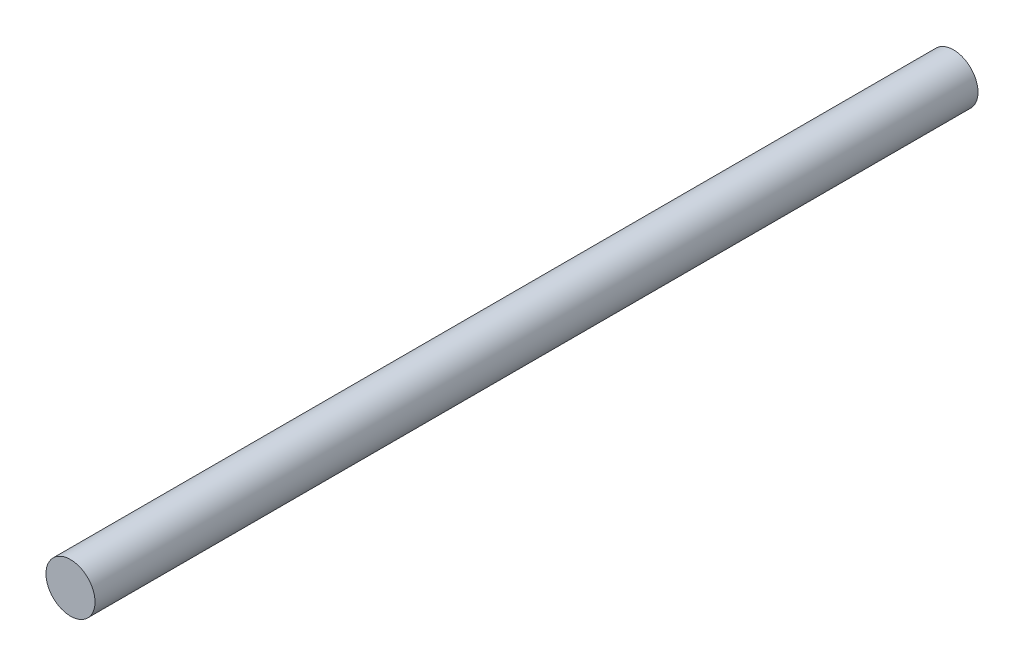
ISO-10303-21;
HEADER;
FILE_DESCRIPTION(('STEP AP214'),'2;1');
FILE_NAME('part.step','',(''),(''),'','','');
FILE_SCHEMA(('AUTOMOTIVE_DESIGN { 1 0 10303 214 1 1 1 1 }'));
ENDSEC;
DATA;
#1=APPLICATION_CONTEXT('core data for automotive mechanical design processes');
#2=APPLICATION_PROTOCOL_DEFINITION('international standard','automotive_design',2000,#1);
#3=PRODUCT_CONTEXT('',#1,'mechanical');
#4=PRODUCT('Part','Part','',(#3));
#5=PRODUCT_RELATED_PRODUCT_CATEGORY('part','',(#4));
#6=PRODUCT_DEFINITION_FORMATION('','',#4);
#7=PRODUCT_DEFINITION_CONTEXT('part definition',#1,'design');
#8=PRODUCT_DEFINITION('design','',#6,#7);
#9=PRODUCT_DEFINITION_SHAPE('','',#8);
#10=(LENGTH_UNIT() NAMED_UNIT(*) SI_UNIT(.MILLI.,.METRE.));
#11=(NAMED_UNIT(*) PLANE_ANGLE_UNIT() SI_UNIT($,.RADIAN.));
#12=(NAMED_UNIT(*) SI_UNIT($,.STERADIAN.) SOLID_ANGLE_UNIT());
#13=UNCERTAINTY_MEASURE_WITH_UNIT(LENGTH_MEASURE(1.E-05),#10,'distance_accuracy_value','');
#14=(GEOMETRIC_REPRESENTATION_CONTEXT(3) GLOBAL_UNCERTAINTY_ASSIGNED_CONTEXT((#13)) GLOBAL_UNIT_ASSIGNED_CONTEXT((#10,
#11,#12)) REPRESENTATION_CONTEXT('',''));
#15=CARTESIAN_POINT('',(0.,0.,0.));
#16=DIRECTION('',(0.,0.,1.));
#17=DIRECTION('',(1.,0.,0.));
#18=AXIS2_PLACEMENT_3D('',#15,#16,#17);
#19=CARTESIAN_POINT('',(0.,0.,900.));
#20=DIRECTION('',(0.,0.,-1.));
#21=DIRECTION('',(-1.,0.,0.));
#22=AXIS2_PLACEMENT_3D('',#19,#20,#21);
#23=CYLINDRICAL_SURFACE('',#22,25.);
#24=CARTESIAN_POINT('',(0.,0.,900.));
#25=DIRECTION('',(0.,0.,1.));
#26=DIRECTION('',(1.,0.,0.));
#27=AXIS2_PLACEMENT_3D('',#24,#25,#26);
#28=CIRCLE('',#27,25.);
#29=CARTESIAN_POINT('',(25.,0.,900.));
#30=VERTEX_POINT('',#29);
#31=EDGE_CURVE('E10',#30,#30,#28,.T.);
#32=ORIENTED_EDGE('',*,*,#31,.F.);
#33=EDGE_LOOP('',(#32));
#34=FACE_BOUND('',#33,.T.);
#35=CARTESIAN_POINT('',(0.,0.,0.));
#36=DIRECTION('',(0.,0.,1.));
#37=DIRECTION('',(1.,0.,0.));
#38=AXIS2_PLACEMENT_3D('',#35,#36,#37);
#39=CIRCLE('',#38,25.);
#40=CARTESIAN_POINT('',(25.,0.,0.));
#41=VERTEX_POINT('',#40);
#42=EDGE_CURVE('E34',#41,#41,#39,.T.);
#43=ORIENTED_EDGE('',*,*,#42,.T.);
#44=EDGE_LOOP('',(#43));
#45=FACE_BOUND('',#44,.T.);
#46=ADVANCED_FACE('F31',(#34,#45),#23,.T.);
#47=CARTESIAN_POINT('',(0.,0.,900.));
#48=DIRECTION('',(0.,0.,1.));
#49=DIRECTION('',(1.,0.,0.));
#50=AXIS2_PLACEMENT_3D('',#47,#48,#49);
#51=PLANE('',#50);
#52=ORIENTED_EDGE('',*,*,#31,.T.);
#53=EDGE_LOOP('',(#52));
#54=FACE_BOUND('',#53,.T.);
#55=ADVANCED_FACE('F46',(#54),#51,.T.);
#56=CARTESIAN_POINT('',(0.,0.,0.));
#57=DIRECTION('',(0.,0.,1.));
#58=DIRECTION('',(1.,0.,0.));
#59=AXIS2_PLACEMENT_3D('',#56,#57,#58);
#60=PLANE('',#59);
#61=ORIENTED_EDGE('',*,*,#42,.F.);
#62=EDGE_LOOP('',(#61));
#63=FACE_BOUND('',#62,.T.);
#64=ADVANCED_FACE('F44',(#63),#60,.F.);
#65=CLOSED_SHELL('',(#46,#55,#64));
#66=MANIFOLD_SOLID_BREP('B2',#65);
#67=ADVANCED_BREP_SHAPE_REPRESENTATION('',(#18,#66),#14);
#68=SHAPE_DEFINITION_REPRESENTATION(#9,#67);
ENDSEC;
END-ISO-10303-21;
